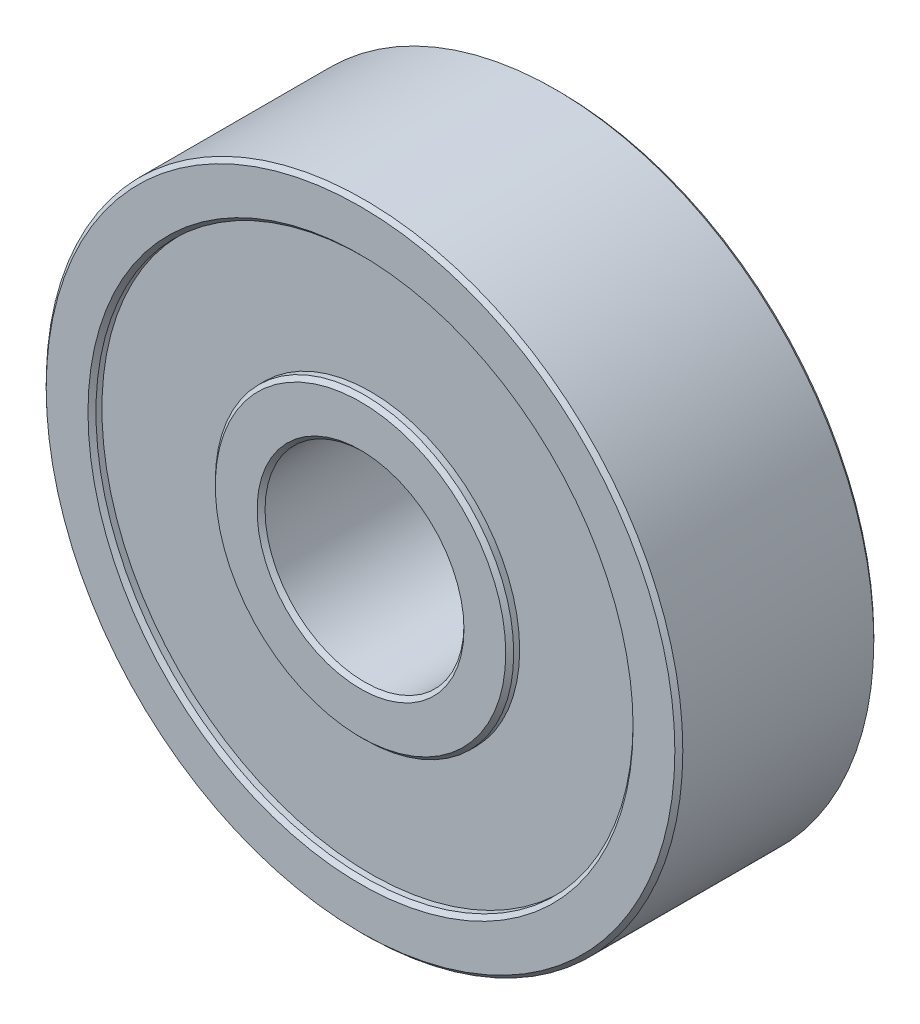
ISO-10303-21;
HEADER;
FILE_DESCRIPTION(('STEP AP214'),'2;1');
FILE_NAME('part.step','',(''),(''),'','','');
FILE_SCHEMA(('AUTOMOTIVE_DESIGN { 1 0 10303 214 1 1 1 1 }'));
ENDSEC;
DATA;
#1=APPLICATION_CONTEXT('core data for automotive mechanical design processes');
#2=APPLICATION_PROTOCOL_DEFINITION('international standard','automotive_design',2000,#1);
#3=PRODUCT_CONTEXT('',#1,'mechanical');
#4=PRODUCT('Part','Part','',(#3));
#5=PRODUCT_RELATED_PRODUCT_CATEGORY('part','',(#4));
#6=PRODUCT_DEFINITION_FORMATION('','',#4);
#7=PRODUCT_DEFINITION_CONTEXT('part definition',#1,'design');
#8=PRODUCT_DEFINITION('design','',#6,#7);
#9=PRODUCT_DEFINITION_SHAPE('','',#8);
#10=(LENGTH_UNIT() NAMED_UNIT(*) SI_UNIT(.MILLI.,.METRE.));
#11=(NAMED_UNIT(*) PLANE_ANGLE_UNIT() SI_UNIT($,.RADIAN.));
#12=(NAMED_UNIT(*) SI_UNIT($,.STERADIAN.) SOLID_ANGLE_UNIT());
#13=UNCERTAINTY_MEASURE_WITH_UNIT(LENGTH_MEASURE(1.E-05),#10,'distance_accuracy_value','');
#14=(GEOMETRIC_REPRESENTATION_CONTEXT(3) GLOBAL_UNCERTAINTY_ASSIGNED_CONTEXT((#13)) GLOBAL_UNIT_ASSIGNED_CONTEXT((#10,
#11,#12)) REPRESENTATION_CONTEXT('',''));
#15=CARTESIAN_POINT('',(0.,0.,0.));
#16=DIRECTION('',(0.,0.,1.));
#17=DIRECTION('',(1.,0.,0.));
#18=AXIS2_PLACEMENT_3D('',#15,#16,#17);
#19=CARTESIAN_POINT('',(0.,0.,2.5));
#20=DIRECTION('',(0.,0.,1.));
#21=DIRECTION('',(1.,0.,0.));
#22=AXIS2_PLACEMENT_3D('',#19,#20,#21);
#23=PLANE('',#22);
#24=CARTESIAN_POINT('',(0.,0.,2.5));
#25=DIRECTION('',(0.,0.,1.));
#26=DIRECTION('',(1.,0.,0.));
#27=AXIS2_PLACEMENT_3D('',#24,#25,#26);
#28=CIRCLE('',#27,3.65);
#29=CARTESIAN_POINT('',(3.65,0.,2.5));
#30=VERTEX_POINT('',#29);
#31=EDGE_CURVE('E54',#30,#30,#28,.T.);
#32=ORIENTED_EDGE('',*,*,#31,.T.);
#33=EDGE_LOOP('',(#32));
#34=FACE_BOUND('',#33,.T.);
#35=CARTESIAN_POINT('',(0.,0.,2.5));
#36=DIRECTION('',(0.,0.,1.));
#37=DIRECTION('',(1.,0.,0.));
#38=AXIS2_PLACEMENT_3D('',#35,#36,#37);
#39=CIRCLE('',#38,2.6);
#40=CARTESIAN_POINT('',(2.6,0.,2.5));
#41=VERTEX_POINT('',#40);
#42=EDGE_CURVE('E57',#41,#41,#39,.F.);
#43=ORIENTED_EDGE('',*,*,#42,.T.);
#44=EDGE_LOOP('',(#43));
#45=FACE_BOUND('',#44,.T.);
#46=ADVANCED_FACE('F34',(#34,#45),#23,.T.);
#47=CARTESIAN_POINT('',(0.,0.,-2.5));
#48=DIRECTION('',(0.,0.,1.));
#49=DIRECTION('',(1.,0.,0.));
#50=AXIS2_PLACEMENT_3D('',#47,#48,#49);
#51=PLANE('',#50);
#52=CARTESIAN_POINT('',(0.,0.,-2.5));
#53=DIRECTION('',(0.,0.,1.));
#54=DIRECTION('',(1.,0.,0.));
#55=AXIS2_PLACEMENT_3D('',#52,#53,#54);
#56=CIRCLE('',#55,6.84999999999999);
#57=CARTESIAN_POINT('',(6.84999999999999,0.,-2.5));
#58=VERTEX_POINT('',#57);
#59=EDGE_CURVE('E69',#58,#58,#56,.T.);
#60=ORIENTED_EDGE('',*,*,#59,.T.);
#61=EDGE_LOOP('',(#60));
#62=FACE_BOUND('',#61,.T.);
#63=CARTESIAN_POINT('',(0.,0.,-2.5));
#64=DIRECTION('',(0.,0.,1.));
#65=DIRECTION('',(1.,0.,0.));
#66=AXIS2_PLACEMENT_3D('',#63,#64,#65);
#67=CIRCLE('',#66,7.9);
#68=CARTESIAN_POINT('',(7.9,0.,-2.5));
#69=VERTEX_POINT('',#68);
#70=EDGE_CURVE('E72',#69,#69,#67,.F.);
#71=ORIENTED_EDGE('',*,*,#70,.T.);
#72=EDGE_LOOP('',(#71));
#73=FACE_BOUND('',#72,.T.);
#74=ADVANCED_FACE('F122',(#62,#73),#51,.F.);
#75=CARTESIAN_POINT('',(0.,0.,-2.5));
#76=DIRECTION('',(0.,0.,1.));
#77=DIRECTION('',(1.,0.,0.));
#78=AXIS2_PLACEMENT_3D('',#75,#76,#77);
#79=CYLINDRICAL_SURFACE('',#78,8.);
#80=CARTESIAN_POINT('',(0.,0.,-2.4));
#81=DIRECTION('',(0.,0.,1.));
#82=DIRECTION('',(1.,0.,0.));
#83=AXIS2_PLACEMENT_3D('',#80,#81,#82);
#84=CIRCLE('',#83,8.);
#85=CARTESIAN_POINT('',(8.,0.,-2.4));
#86=VERTEX_POINT('',#85);
#87=EDGE_CURVE('E60',#86,#86,#84,.T.);
#88=ORIENTED_EDGE('',*,*,#87,.T.);
#89=EDGE_LOOP('',(#88));
#90=FACE_BOUND('',#89,.T.);
#91=CARTESIAN_POINT('',(0.,0.,2.4));
#92=DIRECTION('',(0.,0.,1.));
#93=DIRECTION('',(1.,0.,0.));
#94=AXIS2_PLACEMENT_3D('',#91,#92,#93);
#95=CIRCLE('',#94,8.);
#96=CARTESIAN_POINT('',(8.,0.,2.4));
#97=VERTEX_POINT('',#96);
#98=EDGE_CURVE('E63',#97,#97,#95,.F.);
#99=ORIENTED_EDGE('',*,*,#98,.T.);
#100=EDGE_LOOP('',(#99));
#101=FACE_BOUND('',#100,.T.);
#102=ADVANCED_FACE('F129',(#90,#101),#79,.T.);
#103=CARTESIAN_POINT('',(0.,0.,-2.5));
#104=DIRECTION('',(0.,0.,1.));
#105=DIRECTION('',(1.,0.,0.));
#106=AXIS2_PLACEMENT_3D('',#103,#104,#105);
#107=CIRCLE('',#106,2.6);
#108=CARTESIAN_POINT('',(2.6,0.,-2.5));
#109=VERTEX_POINT('',#108);
#110=EDGE_CURVE('E84',#109,#109,#107,.T.);
#111=ORIENTED_EDGE('',*,*,#110,.T.);
#112=EDGE_LOOP('',(#111));
#113=FACE_BOUND('',#112,.T.);
#114=CARTESIAN_POINT('',(0.,0.,-2.5));
#115=DIRECTION('',(0.,0.,1.));
#116=DIRECTION('',(1.,0.,0.));
#117=AXIS2_PLACEMENT_3D('',#114,#115,#116);
#118=CIRCLE('',#117,3.65);
#119=CARTESIAN_POINT('',(3.65,0.,-2.5));
#120=VERTEX_POINT('',#119);
#121=EDGE_CURVE('E87',#120,#120,#118,.F.);
#122=ORIENTED_EDGE('',*,*,#121,.T.);
#123=EDGE_LOOP('',(#122));
#124=FACE_BOUND('',#123,.T.);
#125=ADVANCED_FACE('F132',(#113,#124),#51,.F.);
#126=CARTESIAN_POINT('',(0.,0.,-2.5));
#127=DIRECTION('',(0.,0.,1.));
#128=DIRECTION('',(1.,0.,0.));
#129=AXIS2_PLACEMENT_3D('',#126,#127,#128);
#130=CYLINDRICAL_SURFACE('',#129,2.5);
#131=CARTESIAN_POINT('',(0.,0.,-2.4));
#132=DIRECTION('',(0.,0.,1.));
#133=DIRECTION('',(1.,0.,0.));
#134=AXIS2_PLACEMENT_3D('',#131,#132,#133);
#135=CIRCLE('',#134,2.5);
#136=CARTESIAN_POINT('',(2.5,0.,-2.4));
#137=VERTEX_POINT('',#136);
#138=EDGE_CURVE('E78',#137,#137,#135,.F.);
#139=ORIENTED_EDGE('',*,*,#138,.T.);
#140=EDGE_LOOP('',(#139));
#141=FACE_BOUND('',#140,.T.);
#142=CARTESIAN_POINT('',(0.,0.,2.4));
#143=DIRECTION('',(0.,0.,1.));
#144=DIRECTION('',(1.,0.,0.));
#145=AXIS2_PLACEMENT_3D('',#142,#143,#144);
#146=CIRCLE('',#145,2.5);
#147=CARTESIAN_POINT('',(2.5,0.,2.4));
#148=VERTEX_POINT('',#147);
#149=EDGE_CURVE('E81',#148,#148,#146,.T.);
#150=ORIENTED_EDGE('',*,*,#149,.T.);
#151=EDGE_LOOP('',(#150));
#152=FACE_BOUND('',#151,.T.);
#153=ADVANCED_FACE('F138',(#141,#152),#130,.F.);
#154=CARTESIAN_POINT('',(0.,0.,2.5));
#155=DIRECTION('',(0.,0.,1.));
#156=DIRECTION('',(1.,0.,0.));
#157=AXIS2_PLACEMENT_3D('',#154,#155,#156);
#158=CIRCLE('',#157,7.9);
#159=CARTESIAN_POINT('',(7.9,0.,2.5));
#160=VERTEX_POINT('',#159);
#161=EDGE_CURVE('E41',#160,#160,#158,.T.);
#162=ORIENTED_EDGE('',*,*,#161,.T.);
#163=EDGE_LOOP('',(#162));
#164=FACE_BOUND('',#163,.T.);
#165=CARTESIAN_POINT('',(0.,0.,2.5));
#166=DIRECTION('',(0.,0.,1.));
#167=DIRECTION('',(1.,0.,0.));
#168=AXIS2_PLACEMENT_3D('',#165,#166,#167);
#169=CIRCLE('',#168,6.85);
#170=CARTESIAN_POINT('',(6.85,0.,2.5));
#171=VERTEX_POINT('',#170);
#172=EDGE_CURVE('E45',#171,#171,#169,.F.);
#173=ORIENTED_EDGE('',*,*,#172,.T.);
#174=EDGE_LOOP('',(#173));
#175=FACE_BOUND('',#174,.T.);
#176=ADVANCED_FACE('F125',(#164,#175),#23,.T.);
#177=CARTESIAN_POINT('',(0.,0.,-2.25));
#178=DIRECTION('',(0.,0.,1.));
#179=DIRECTION('',(1.,0.,0.));
#180=AXIS2_PLACEMENT_3D('',#177,#178,#179);
#181=PLANE('',#180);
#182=CARTESIAN_POINT('',(0.,0.,-2.25));
#183=DIRECTION('',(0.,0.,1.));
#184=DIRECTION('',(1.,0.,0.));
#185=AXIS2_PLACEMENT_3D('',#182,#183,#184);
#186=CIRCLE('',#185,6.75);
#187=CARTESIAN_POINT('',(6.75,0.,-2.25));
#188=VERTEX_POINT('',#187);
#189=EDGE_CURVE('E90',#188,#188,#186,.T.);
#190=ORIENTED_EDGE('',*,*,#189,.F.);
#191=EDGE_LOOP('',(#190));
#192=FACE_BOUND('',#191,.T.);
#193=CARTESIAN_POINT('',(0.,0.,-2.25));
#194=DIRECTION('',(0.,0.,1.));
#195=DIRECTION('',(1.,0.,0.));
#196=AXIS2_PLACEMENT_3D('',#193,#194,#195);
#197=CIRCLE('',#196,3.75);
#198=CARTESIAN_POINT('',(3.75,0.,-2.25));
#199=VERTEX_POINT('',#198);
#200=EDGE_CURVE('E93',#199,#199,#197,.T.);
#201=ORIENTED_EDGE('',*,*,#200,.T.);
#202=EDGE_LOOP('',(#201));
#203=FACE_BOUND('',#202,.T.);
#204=ADVANCED_FACE('F137',(#192,#203),#181,.F.);
#205=CARTESIAN_POINT('',(0.,0.,-2.25));
#206=DIRECTION('',(0.,0.,-1.));
#207=DIRECTION('',(-1.,0.,0.));
#208=AXIS2_PLACEMENT_3D('',#205,#206,#207);
#209=CYLINDRICAL_SURFACE('',#208,6.75);
#210=CARTESIAN_POINT('',(0.,0.,-2.4));
#211=DIRECTION('',(0.,0.,1.));
#212=DIRECTION('',(1.,0.,0.));
#213=AXIS2_PLACEMENT_3D('',#210,#211,#212);
#214=CIRCLE('',#213,6.75);
#215=CARTESIAN_POINT('',(6.75,0.,-2.4));
#216=VERTEX_POINT('',#215);
#217=EDGE_CURVE('E66',#216,#216,#214,.F.);
#218=ORIENTED_EDGE('',*,*,#217,.T.);
#219=EDGE_LOOP('',(#218));
#220=FACE_BOUND('',#219,.T.);
#221=ORIENTED_EDGE('',*,*,#189,.T.);
#222=EDGE_LOOP('',(#221));
#223=FACE_BOUND('',#222,.T.);
#224=ADVANCED_FACE('F118',(#220,#223),#209,.F.);
#225=CARTESIAN_POINT('',(0.,0.,-2.25));
#226=DIRECTION('',(0.,0.,-1.));
#227=DIRECTION('',(-1.,0.,0.));
#228=AXIS2_PLACEMENT_3D('',#225,#226,#227);
#229=CYLINDRICAL_SURFACE('',#228,3.75);
#230=CARTESIAN_POINT('',(0.,0.,-2.4));
#231=DIRECTION('',(0.,0.,1.));
#232=DIRECTION('',(1.,0.,0.));
#233=AXIS2_PLACEMENT_3D('',#230,#231,#232);
#234=CIRCLE('',#233,3.75);
#235=CARTESIAN_POINT('',(3.75,0.,-2.4));
#236=VERTEX_POINT('',#235);
#237=EDGE_CURVE('E75',#236,#236,#234,.T.);
#238=ORIENTED_EDGE('',*,*,#237,.T.);
#239=EDGE_LOOP('',(#238));
#240=FACE_BOUND('',#239,.T.);
#241=ORIENTED_EDGE('',*,*,#200,.F.);
#242=EDGE_LOOP('',(#241));
#243=FACE_BOUND('',#242,.T.);
#244=ADVANCED_FACE('F113',(#240,#243),#229,.T.);
#245=CARTESIAN_POINT('',(0.,0.,2.25));
#246=DIRECTION('',(0.,0.,1.));
#247=DIRECTION('',(1.,0.,0.));
#248=AXIS2_PLACEMENT_3D('',#245,#246,#247);
#249=CYLINDRICAL_SURFACE('',#248,6.75);
#250=CARTESIAN_POINT('',(0.,0.,2.4));
#251=DIRECTION('',(0.,0.,1.));
#252=DIRECTION('',(1.,0.,0.));
#253=AXIS2_PLACEMENT_3D('',#250,#251,#252);
#254=CIRCLE('',#253,6.75);
#255=CARTESIAN_POINT('',(6.75,0.,2.4));
#256=VERTEX_POINT('',#255);
#257=EDGE_CURVE('E10',#256,#256,#254,.T.);
#258=ORIENTED_EDGE('',*,*,#257,.T.);
#259=EDGE_LOOP('',(#258));
#260=FACE_BOUND('',#259,.T.);
#261=CARTESIAN_POINT('',(0.,0.,2.25));
#262=DIRECTION('',(0.,0.,1.));
#263=DIRECTION('',(1.,0.,0.));
#264=AXIS2_PLACEMENT_3D('',#261,#262,#263);
#265=CIRCLE('',#264,6.75);
#266=CARTESIAN_POINT('',(6.75,0.,2.25));
#267=VERTEX_POINT('',#266);
#268=EDGE_CURVE('E96',#267,#267,#265,.T.);
#269=ORIENTED_EDGE('',*,*,#268,.F.);
#270=EDGE_LOOP('',(#269));
#271=FACE_BOUND('',#270,.T.);
#272=ADVANCED_FACE('F108',(#260,#271),#249,.F.);
#273=CARTESIAN_POINT('',(0.,0.,2.25));
#274=DIRECTION('',(0.,0.,1.));
#275=DIRECTION('',(1.,0.,0.));
#276=AXIS2_PLACEMENT_3D('',#273,#274,#275);
#277=PLANE('',#276);
#278=CARTESIAN_POINT('',(0.,0.,2.25));
#279=DIRECTION('',(0.,0.,1.));
#280=DIRECTION('',(1.,0.,0.));
#281=AXIS2_PLACEMENT_3D('',#278,#279,#280);
#282=CIRCLE('',#281,3.75);
#283=CARTESIAN_POINT('',(3.75,0.,2.25));
#284=VERTEX_POINT('',#283);
#285=EDGE_CURVE('E99',#284,#284,#282,.T.);
#286=ORIENTED_EDGE('',*,*,#285,.F.);
#287=EDGE_LOOP('',(#286));
#288=FACE_BOUND('',#287,.T.);
#289=ORIENTED_EDGE('',*,*,#268,.T.);
#290=EDGE_LOOP('',(#289));
#291=FACE_BOUND('',#290,.T.);
#292=ADVANCED_FACE('F105',(#288,#291),#277,.T.);
#293=CARTESIAN_POINT('',(0.,0.,2.25));
#294=DIRECTION('',(0.,0.,1.));
#295=DIRECTION('',(1.,0.,0.));
#296=AXIS2_PLACEMENT_3D('',#293,#294,#295);
#297=CYLINDRICAL_SURFACE('',#296,3.75);
#298=CARTESIAN_POINT('',(0.,0.,2.4));
#299=DIRECTION('',(0.,0.,1.));
#300=DIRECTION('',(1.,0.,0.));
#301=AXIS2_PLACEMENT_3D('',#298,#299,#300);
#302=CIRCLE('',#301,3.75);
#303=CARTESIAN_POINT('',(3.75,0.,2.4));
#304=VERTEX_POINT('',#303);
#305=EDGE_CURVE('E49',#304,#304,#302,.F.);
#306=ORIENTED_EDGE('',*,*,#305,.T.);
#307=EDGE_LOOP('',(#306));
#308=FACE_BOUND('',#307,.T.);
#309=ORIENTED_EDGE('',*,*,#285,.T.);
#310=EDGE_LOOP('',(#309));
#311=FACE_BOUND('',#310,.T.);
#312=ADVANCED_FACE('F103',(#308,#311),#297,.T.);
#313=CARTESIAN_POINT('',(0.,0.,-2.5));
#314=DIRECTION('',(0.,0.,-1.));
#315=DIRECTION('',(-1.,0.,0.));
#316=AXIS2_PLACEMENT_3D('',#313,#314,#315);
#317=CONICAL_SURFACE('',#316,2.6,0.785398163397446);
#318=ORIENTED_EDGE('',*,*,#138,.F.);
#319=EDGE_LOOP('',(#318));
#320=FACE_BOUND('',#319,.T.);
#321=ORIENTED_EDGE('',*,*,#110,.F.);
#322=EDGE_LOOP('',(#321));
#323=FACE_BOUND('',#322,.T.);
#324=ADVANCED_FACE('F180',(#320,#323),#317,.F.);
#325=CARTESIAN_POINT('',(0.,0.,-2.4));
#326=DIRECTION('',(0.,0.,1.));
#327=DIRECTION('',(1.,0.,0.));
#328=AXIS2_PLACEMENT_3D('',#325,#326,#327);
#329=CONICAL_SURFACE('',#328,3.75,0.785398163397453);
#330=ORIENTED_EDGE('',*,*,#121,.F.);
#331=EDGE_LOOP('',(#330));
#332=FACE_BOUND('',#331,.T.);
#333=ORIENTED_EDGE('',*,*,#237,.F.);
#334=EDGE_LOOP('',(#333));
#335=FACE_BOUND('',#334,.T.);
#336=ADVANCED_FACE('F176',(#332,#335),#329,.T.);
#337=CARTESIAN_POINT('',(0.,0.,-2.5));
#338=DIRECTION('',(0.,0.,-1.));
#339=DIRECTION('',(-1.,0.,0.));
#340=AXIS2_PLACEMENT_3D('',#337,#338,#339);
#341=CONICAL_SURFACE('',#340,6.84999999999999,0.785398163397444);
#342=ORIENTED_EDGE('',*,*,#217,.F.);
#343=EDGE_LOOP('',(#342));
#344=FACE_BOUND('',#343,.T.);
#345=ORIENTED_EDGE('',*,*,#59,.F.);
#346=EDGE_LOOP('',(#345));
#347=FACE_BOUND('',#346,.T.);
#348=ADVANCED_FACE('F172',(#344,#347),#341,.F.);
#349=CARTESIAN_POINT('',(0.,0.,-2.4));
#350=DIRECTION('',(0.,0.,1.));
#351=DIRECTION('',(1.,0.,0.));
#352=AXIS2_PLACEMENT_3D('',#349,#350,#351);
#353=CONICAL_SURFACE('',#352,8.,0.785398163397457);
#354=ORIENTED_EDGE('',*,*,#70,.F.);
#355=EDGE_LOOP('',(#354));
#356=FACE_BOUND('',#355,.T.);
#357=ORIENTED_EDGE('',*,*,#87,.F.);
#358=EDGE_LOOP('',(#357));
#359=FACE_BOUND('',#358,.T.);
#360=ADVANCED_FACE('F168',(#356,#359),#353,.T.);
#361=CARTESIAN_POINT('',(0.,0.,2.5));
#362=DIRECTION('',(0.,0.,-1.));
#363=DIRECTION('',(-1.,0.,0.));
#364=AXIS2_PLACEMENT_3D('',#361,#362,#363);
#365=CONICAL_SURFACE('',#364,3.65,0.785398163397453);
#366=ORIENTED_EDGE('',*,*,#305,.F.);
#367=EDGE_LOOP('',(#366));
#368=FACE_BOUND('',#367,.T.);
#369=ORIENTED_EDGE('',*,*,#31,.F.);
#370=EDGE_LOOP('',(#369));
#371=FACE_BOUND('',#370,.T.);
#372=ADVANCED_FACE('F160',(#368,#371),#365,.T.);
#373=CARTESIAN_POINT('',(0.,0.,2.4));
#374=DIRECTION('',(0.,0.,1.));
#375=DIRECTION('',(1.,0.,0.));
#376=AXIS2_PLACEMENT_3D('',#373,#374,#375);
#377=CONICAL_SURFACE('',#376,2.5,0.78539816339745);
#378=ORIENTED_EDGE('',*,*,#42,.F.);
#379=EDGE_LOOP('',(#378));
#380=FACE_BOUND('',#379,.T.);
#381=ORIENTED_EDGE('',*,*,#149,.F.);
#382=EDGE_LOOP('',(#381));
#383=FACE_BOUND('',#382,.T.);
#384=ADVANCED_FACE('F155',(#380,#383),#377,.F.);
#385=CARTESIAN_POINT('',(0.,0.,2.5));
#386=DIRECTION('',(0.,0.,-1.));
#387=DIRECTION('',(-1.,0.,0.));
#388=AXIS2_PLACEMENT_3D('',#385,#386,#387);
#389=CONICAL_SURFACE('',#388,7.9,0.785398163397448);
#390=ORIENTED_EDGE('',*,*,#98,.F.);
#391=EDGE_LOOP('',(#390));
#392=FACE_BOUND('',#391,.T.);
#393=ORIENTED_EDGE('',*,*,#161,.F.);
#394=EDGE_LOOP('',(#393));
#395=FACE_BOUND('',#394,.T.);
#396=ADVANCED_FACE('F151',(#392,#395),#389,.T.);
#397=CARTESIAN_POINT('',(0.,0.,2.4));
#398=DIRECTION('',(0.,0.,1.));
#399=DIRECTION('',(1.,0.,0.));
#400=AXIS2_PLACEMENT_3D('',#397,#398,#399);
#401=CONICAL_SURFACE('',#400,6.75,0.785398163397444);
#402=ORIENTED_EDGE('',*,*,#172,.F.);
#403=EDGE_LOOP('',(#402));
#404=FACE_BOUND('',#403,.T.);
#405=ORIENTED_EDGE('',*,*,#257,.F.);
#406=EDGE_LOOP('',(#405));
#407=FACE_BOUND('',#406,.T.);
#408=ADVANCED_FACE('F36',(#404,#407),#401,.F.);
#409=CLOSED_SHELL('',(#46,#74,#102,#125,#153,#176,#204,#224,#244,#272,#292,#312,#324,#336,#348,
#360,#372,#384,#396,#408));
#410=MANIFOLD_SOLID_BREP('B2',#409);
#411=ADVANCED_BREP_SHAPE_REPRESENTATION('',(#18,#410),#14);
#412=SHAPE_DEFINITION_REPRESENTATION(#9,#411);
ENDSEC;
END-ISO-10303-21;
